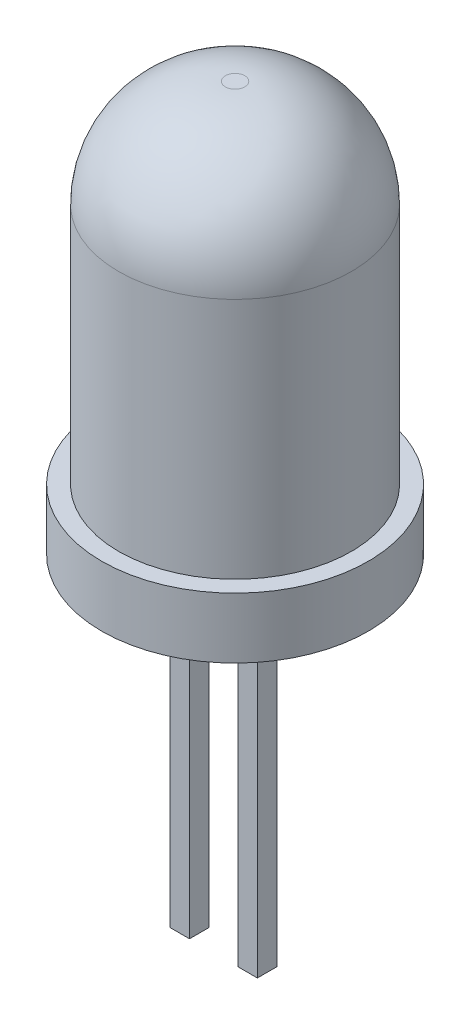
ISO-10303-21;
HEADER;
FILE_DESCRIPTION(('STEP AP214'),'2;1');
FILE_NAME('part.step','',(''),(''),'','','');
FILE_SCHEMA(('AUTOMOTIVE_DESIGN { 1 0 10303 214 1 1 1 1 }'));
ENDSEC;
DATA;
#1=APPLICATION_CONTEXT('core data for automotive mechanical design processes');
#2=APPLICATION_PROTOCOL_DEFINITION('international standard','automotive_design',2000,#1);
#3=PRODUCT_CONTEXT('',#1,'mechanical');
#4=PRODUCT('Part','Part','',(#3));
#5=PRODUCT_RELATED_PRODUCT_CATEGORY('part','',(#4));
#6=PRODUCT_DEFINITION_FORMATION('','',#4);
#7=PRODUCT_DEFINITION_CONTEXT('part definition',#1,'design');
#8=PRODUCT_DEFINITION('design','',#6,#7);
#9=PRODUCT_DEFINITION_SHAPE('','',#8);
#10=(LENGTH_UNIT() NAMED_UNIT(*) SI_UNIT(.MILLI.,.METRE.));
#11=(NAMED_UNIT(*) PLANE_ANGLE_UNIT() SI_UNIT($,.RADIAN.));
#12=(NAMED_UNIT(*) SI_UNIT($,.STERADIAN.) SOLID_ANGLE_UNIT());
#13=UNCERTAINTY_MEASURE_WITH_UNIT(LENGTH_MEASURE(1.E-05),#10,'distance_accuracy_value','');
#14=(GEOMETRIC_REPRESENTATION_CONTEXT(3) GLOBAL_UNCERTAINTY_ASSIGNED_CONTEXT((#13)) GLOBAL_UNIT_ASSIGNED_CONTEXT((#10,
#11,#12)) REPRESENTATION_CONTEXT('',''));
#15=CARTESIAN_POINT('',(0.,0.,0.));
#16=DIRECTION('',(0.,0.,1.));
#17=DIRECTION('',(1.,0.,0.));
#18=AXIS2_PLACEMENT_3D('',#15,#16,#17);
#19=CARTESIAN_POINT('',(0.,0.,0.));
#20=DIRECTION('',(0.,1.,0.));
#21=DIRECTION('',(0.,0.,1.));
#22=AXIS2_PLACEMENT_3D('',#19,#20,#21);
#23=PLANE('',#22);
#24=DIRECTION('',(-1.,0.,0.));
#25=VECTOR('',#24,1.);
#26=CARTESIAN_POINT('',(0.6,0.,-0.260309902991196));
#27=LINE('',#26,#25);
#28=CARTESIAN_POINT('',(0.6,0.,-0.260309902991196));
#29=VERTEX_POINT('',#28);
#30=CARTESIAN_POINT('',(0.2,0.,-0.260309902991196));
#31=VERTEX_POINT('',#30);
#32=EDGE_CURVE('E143',#29,#31,#27,.T.);
#33=ORIENTED_EDGE('',*,*,#32,.T.);
#34=DIRECTION('',(0.,0.,1.));
#35=VECTOR('',#34,1.);
#36=CARTESIAN_POINT('',(0.2,0.,0.139690097008804));
#37=LINE('',#36,#35);
#38=CARTESIAN_POINT('',(0.2,0.,0.139690097008804));
#39=VERTEX_POINT('',#38);
#40=EDGE_CURVE('E111',#31,#39,#37,.T.);
#41=ORIENTED_EDGE('',*,*,#40,.T.);
#42=DIRECTION('',(1.,0.,0.));
#43=VECTOR('',#42,1.);
#44=CARTESIAN_POINT('',(0.6,0.,0.139690097008804));
#45=LINE('',#44,#43);
#46=CARTESIAN_POINT('',(0.6,0.,0.139690097008804));
#47=VERTEX_POINT('',#46);
#48=EDGE_CURVE('E129',#39,#47,#45,.T.);
#49=ORIENTED_EDGE('',*,*,#48,.T.);
#50=DIRECTION('',(0.,0.,-1.));
#51=VECTOR('',#50,1.);
#52=CARTESIAN_POINT('',(0.6,0.,0.139690097008804));
#53=LINE('',#52,#51);
#54=EDGE_CURVE('E55',#47,#29,#53,.T.);
#55=ORIENTED_EDGE('',*,*,#54,.T.);
#56=EDGE_LOOP('',(#33,#41,#49,#55));
#57=FACE_BOUND('',#56,.T.);
#58=CARTESIAN_POINT('',(0.,0.,0.));
#59=DIRECTION('',(0.,1.,0.));
#60=DIRECTION('',(0.,0.,1.));
#61=AXIS2_PLACEMENT_3D('',#58,#59,#60);
#62=CIRCLE('',#61,2.75);
#63=CARTESIAN_POINT('',(0.,0.,2.75));
#64=VERTEX_POINT('',#63);
#65=EDGE_CURVE('E199',#64,#64,#62,.T.);
#66=ORIENTED_EDGE('',*,*,#65,.F.);
#67=EDGE_LOOP('',(#66));
#68=FACE_BOUND('',#67,.T.);
#69=DIRECTION('',(0.,0.,1.));
#70=VECTOR('',#69,1.);
#71=CARTESIAN_POINT('',(-0.8,0.,0.139690097008804));
#72=LINE('',#71,#70);
#73=CARTESIAN_POINT('',(-0.8,0.,-0.260309902991196));
#74=VERTEX_POINT('',#73);
#75=CARTESIAN_POINT('',(-0.8,0.,0.139690097008804));
#76=VERTEX_POINT('',#75);
#77=EDGE_CURVE('E117',#74,#76,#72,.T.);
#78=ORIENTED_EDGE('',*,*,#77,.F.);
#79=DIRECTION('',(1.,0.,0.));
#80=VECTOR('',#79,1.);
#81=CARTESIAN_POINT('',(-1.2,0.,-0.260309902991196));
#82=LINE('',#81,#80);
#83=CARTESIAN_POINT('',(-1.2,0.,-0.260309902991196));
#84=VERTEX_POINT('',#83);
#85=EDGE_CURVE('E163',#84,#74,#82,.T.);
#86=ORIENTED_EDGE('',*,*,#85,.F.);
#87=DIRECTION('',(0.,0.,-1.));
#88=VECTOR('',#87,1.);
#89=CARTESIAN_POINT('',(-1.2,0.,0.139690097008804));
#90=LINE('',#89,#88);
#91=CARTESIAN_POINT('',(-1.2,0.,0.139690097008804));
#92=VERTEX_POINT('',#91);
#93=EDGE_CURVE('E178',#92,#84,#90,.T.);
#94=ORIENTED_EDGE('',*,*,#93,.F.);
#95=DIRECTION('',(-1.,0.,0.));
#96=VECTOR('',#95,1.);
#97=CARTESIAN_POINT('',(-1.2,0.,0.139690097008804));
#98=LINE('',#97,#96);
#99=EDGE_CURVE('E63',#76,#92,#98,.T.);
#100=ORIENTED_EDGE('',*,*,#99,.F.);
#101=EDGE_LOOP('',(#78,#86,#94,#100));
#102=FACE_BOUND('',#101,.T.);
#103=ADVANCED_FACE('F39',(#57,#68,#102),#23,.F.);
#104=CARTESIAN_POINT('',(0.,1.25,0.));
#105=DIRECTION('',(0.,-1.,0.));
#106=DIRECTION('',(0.,0.,-1.));
#107=AXIS2_PLACEMENT_3D('',#104,#105,#106);
#108=CYLINDRICAL_SURFACE('',#107,2.75);
#109=CARTESIAN_POINT('',(0.,1.25,0.));
#110=DIRECTION('',(0.,1.,0.));
#111=DIRECTION('',(0.,0.,1.));
#112=AXIS2_PLACEMENT_3D('',#109,#110,#111);
#113=CIRCLE('',#112,2.75);
#114=CARTESIAN_POINT('',(0.,1.25,2.75));
#115=VERTEX_POINT('',#114);
#116=EDGE_CURVE('E204',#115,#115,#113,.T.);
#117=ORIENTED_EDGE('',*,*,#116,.F.);
#118=EDGE_LOOP('',(#117));
#119=FACE_BOUND('',#118,.T.);
#120=ORIENTED_EDGE('',*,*,#65,.T.);
#121=EDGE_LOOP('',(#120));
#122=FACE_BOUND('',#121,.T.);
#123=ADVANCED_FACE('F230',(#119,#122),#108,.T.);
#124=CARTESIAN_POINT('',(0.,1.25,0.));
#125=DIRECTION('',(0.,1.,0.));
#126=DIRECTION('',(0.,0.,1.));
#127=AXIS2_PLACEMENT_3D('',#124,#125,#126);
#128=PLANE('',#127);
#129=CARTESIAN_POINT('',(0.,1.25,0.));
#130=DIRECTION('',(0.,1.,0.));
#131=DIRECTION('',(0.,0.,1.));
#132=AXIS2_PLACEMENT_3D('',#129,#130,#131);
#133=CIRCLE('',#132,2.4);
#134=CARTESIAN_POINT('',(0.,1.25,2.4));
#135=VERTEX_POINT('',#134);
#136=EDGE_CURVE('E200',#135,#135,#133,.T.);
#137=ORIENTED_EDGE('',*,*,#136,.F.);
#138=EDGE_LOOP('',(#137));
#139=FACE_BOUND('',#138,.T.);
#140=ORIENTED_EDGE('',*,*,#116,.T.);
#141=EDGE_LOOP('',(#140));
#142=FACE_BOUND('',#141,.T.);
#143=ADVANCED_FACE('F236',(#139,#142),#128,.T.);
#144=CARTESIAN_POINT('',(0.,8.45,0.));
#145=DIRECTION('',(0.,-1.,0.));
#146=DIRECTION('',(0.,0.,-1.));
#147=AXIS2_PLACEMENT_3D('',#144,#145,#146);
#148=CYLINDRICAL_SURFACE('',#147,2.4);
#149=CARTESIAN_POINT('',(0.,6.25,0.));
#150=DIRECTION('',(0.,1.,0.));
#151=DIRECTION('',(0.,0.,1.));
#152=AXIS2_PLACEMENT_3D('',#149,#150,#151);
#153=CIRCLE('',#152,2.4);
#154=CARTESIAN_POINT('',(0.,6.25,2.4));
#155=VERTEX_POINT('',#154);
#156=EDGE_CURVE('E11',#155,#155,#153,.F.);
#157=ORIENTED_EDGE('',*,*,#156,.T.);
#158=EDGE_LOOP('',(#157));
#159=FACE_BOUND('',#158,.T.);
#160=ORIENTED_EDGE('',*,*,#136,.T.);
#161=EDGE_LOOP('',(#160));
#162=FACE_BOUND('',#161,.T.);
#163=ADVANCED_FACE('F226',(#159,#162),#148,.T.);
#164=CARTESIAN_POINT('',(0.,8.45,0.));
#165=DIRECTION('',(0.,1.,0.));
#166=DIRECTION('',(0.,0.,1.));
#167=AXIS2_PLACEMENT_3D('',#164,#165,#166);
#168=PLANE('',#167);
#169=CARTESIAN_POINT('',(0.,8.45,0.));
#170=DIRECTION('',(0.,1.,0.));
#171=DIRECTION('',(0.,0.,1.));
#172=AXIS2_PLACEMENT_3D('',#169,#170,#171);
#173=CIRCLE('',#172,0.2);
#174=CARTESIAN_POINT('',(0.,8.45,0.2));
#175=VERTEX_POINT('',#174);
#176=EDGE_CURVE('E48',#175,#175,#173,.T.);
#177=ORIENTED_EDGE('',*,*,#176,.T.);
#178=EDGE_LOOP('',(#177));
#179=FACE_BOUND('',#178,.T.);
#180=ADVANCED_FACE('F214',(#179),#168,.T.);
#181=CARTESIAN_POINT('',(0.,6.25,0.));
#182=DIRECTION('',(0.,1.,0.));
#183=DIRECTION('',(0.,0.,1.));
#184=AXIS2_PLACEMENT_3D('',#181,#182,#183);
#185=DEGENERATE_TOROIDAL_SURFACE('',#184,0.2,2.2,.T.);
#186=ORIENTED_EDGE('',*,*,#156,.F.);
#187=EDGE_LOOP('',(#186));
#188=FACE_BOUND('',#187,.T.);
#189=ORIENTED_EDGE('',*,*,#176,.F.);
#190=EDGE_LOOP('',(#189));
#191=FACE_BOUND('',#190,.T.);
#192=ADVANCED_FACE('F41',(#188,#191),#185,.T.);
#193=CARTESIAN_POINT('',(-0.8,-7.2,0.139690097008804));
#194=DIRECTION('',(-1.,0.,0.));
#195=DIRECTION('',(0.,0.,1.));
#196=AXIS2_PLACEMENT_3D('',#193,#194,#195);
#197=PLANE('',#196);
#198=ORIENTED_EDGE('',*,*,#77,.T.);
#199=DIRECTION('',(0.,1.,0.));
#200=VECTOR('',#199,1.);
#201=CARTESIAN_POINT('',(-0.8,-7.2,0.139690097008804));
#202=LINE('',#201,#200);
#203=CARTESIAN_POINT('',(-0.8,-7.2,0.139690097008804));
#204=VERTEX_POINT('',#203);
#205=EDGE_CURVE('E196',#204,#76,#202,.T.);
#206=ORIENTED_EDGE('',*,*,#205,.F.);
#207=DIRECTION('',(0.,0.,1.));
#208=VECTOR('',#207,1.);
#209=CARTESIAN_POINT('',(-0.8,-7.2,0.139690097008804));
#210=LINE('',#209,#208);
#211=CARTESIAN_POINT('',(-0.8,-7.2,-0.260309902991196));
#212=VERTEX_POINT('',#211);
#213=EDGE_CURVE('E158',#212,#204,#210,.T.);
#214=ORIENTED_EDGE('',*,*,#213,.F.);
#215=DIRECTION('',(0.,1.,0.));
#216=VECTOR('',#215,1.);
#217=CARTESIAN_POINT('',(-0.8,-7.2,-0.260309902991196));
#218=LINE('',#217,#216);
#219=EDGE_CURVE('E172',#212,#74,#218,.T.);
#220=ORIENTED_EDGE('',*,*,#219,.T.);
#221=EDGE_LOOP('',(#198,#206,#214,#220));
#222=FACE_BOUND('',#221,.T.);
#223=ADVANCED_FACE('F217',(#222),#197,.F.);
#224=CARTESIAN_POINT('',(-1.2,-7.2,0.139690097008804));
#225=DIRECTION('',(0.,0.,-1.));
#226=DIRECTION('',(-1.,0.,0.));
#227=AXIS2_PLACEMENT_3D('',#224,#225,#226);
#228=PLANE('',#227);
#229=ORIENTED_EDGE('',*,*,#99,.T.);
#230=DIRECTION('',(0.,1.,0.));
#231=VECTOR('',#230,1.);
#232=CARTESIAN_POINT('',(-1.2,-7.2,0.139690097008804));
#233=LINE('',#232,#231);
#234=CARTESIAN_POINT('',(-1.2,-7.2,0.139690097008804));
#235=VERTEX_POINT('',#234);
#236=EDGE_CURVE('E192',#235,#92,#233,.T.);
#237=ORIENTED_EDGE('',*,*,#236,.F.);
#238=DIRECTION('',(-1.,0.,0.));
#239=VECTOR('',#238,1.);
#240=CARTESIAN_POINT('',(-1.2,-7.2,0.139690097008804));
#241=LINE('',#240,#239);
#242=EDGE_CURVE('E162',#204,#235,#241,.T.);
#243=ORIENTED_EDGE('',*,*,#242,.F.);
#244=ORIENTED_EDGE('',*,*,#205,.T.);
#245=EDGE_LOOP('',(#229,#237,#243,#244));
#246=FACE_BOUND('',#245,.T.);
#247=ADVANCED_FACE('F223',(#246),#228,.F.);
#248=CARTESIAN_POINT('',(-1.2,-7.2,0.139690097008804));
#249=DIRECTION('',(1.,0.,0.));
#250=DIRECTION('',(0.,0.,-1.));
#251=AXIS2_PLACEMENT_3D('',#248,#249,#250);
#252=PLANE('',#251);
#253=ORIENTED_EDGE('',*,*,#93,.T.);
#254=DIRECTION('',(0.,1.,0.));
#255=VECTOR('',#254,1.);
#256=CARTESIAN_POINT('',(-1.2,-7.2,-0.260309902991196));
#257=LINE('',#256,#255);
#258=CARTESIAN_POINT('',(-1.2,-7.2,-0.260309902991196));
#259=VERTEX_POINT('',#258);
#260=EDGE_CURVE('E188',#259,#84,#257,.T.);
#261=ORIENTED_EDGE('',*,*,#260,.F.);
#262=DIRECTION('',(0.,0.,-1.));
#263=VECTOR('',#262,1.);
#264=CARTESIAN_POINT('',(-1.2,-7.2,0.139690097008804));
#265=LINE('',#264,#263);
#266=EDGE_CURVE('E166',#235,#259,#265,.T.);
#267=ORIENTED_EDGE('',*,*,#266,.F.);
#268=ORIENTED_EDGE('',*,*,#236,.T.);
#269=EDGE_LOOP('',(#253,#261,#267,#268));
#270=FACE_BOUND('',#269,.T.);
#271=ADVANCED_FACE('F248',(#270),#252,.F.);
#272=CARTESIAN_POINT('',(-1.2,-7.2,-0.260309902991196));
#273=DIRECTION('',(0.,0.,1.));
#274=DIRECTION('',(1.,0.,0.));
#275=AXIS2_PLACEMENT_3D('',#272,#273,#274);
#276=PLANE('',#275);
#277=ORIENTED_EDGE('',*,*,#85,.T.);
#278=ORIENTED_EDGE('',*,*,#219,.F.);
#279=DIRECTION('',(1.,0.,0.));
#280=VECTOR('',#279,1.);
#281=CARTESIAN_POINT('',(-1.2,-7.2,-0.260309902991196));
#282=LINE('',#281,#280);
#283=EDGE_CURVE('E169',#259,#212,#282,.T.);
#284=ORIENTED_EDGE('',*,*,#283,.F.);
#285=ORIENTED_EDGE('',*,*,#260,.T.);
#286=EDGE_LOOP('',(#277,#278,#284,#285));
#287=FACE_BOUND('',#286,.T.);
#288=ADVANCED_FACE('F252',(#287),#276,.F.);
#289=CARTESIAN_POINT('',(0.,-7.2,0.));
#290=DIRECTION('',(0.,-1.,0.));
#291=DIRECTION('',(0.,0.,-1.));
#292=AXIS2_PLACEMENT_3D('',#289,#290,#291);
#293=PLANE('',#292);
#294=ORIENTED_EDGE('',*,*,#213,.T.);
#295=ORIENTED_EDGE('',*,*,#242,.T.);
#296=ORIENTED_EDGE('',*,*,#266,.T.);
#297=ORIENTED_EDGE('',*,*,#283,.T.);
#298=EDGE_LOOP('',(#294,#295,#296,#297));
#299=FACE_BOUND('',#298,.T.);
#300=ADVANCED_FACE('F256',(#299),#293,.T.);
#301=CARTESIAN_POINT('',(0.2,-7.2,0.139690097008804));
#302=DIRECTION('',(-1.,0.,0.));
#303=DIRECTION('',(0.,0.,1.));
#304=AXIS2_PLACEMENT_3D('',#301,#302,#303);
#305=PLANE('',#304);
#306=ORIENTED_EDGE('',*,*,#40,.F.);
#307=DIRECTION('',(0.,1.,0.));
#308=VECTOR('',#307,1.);
#309=CARTESIAN_POINT('',(0.2,-7.2,-0.260309902991196));
#310=LINE('',#309,#308);
#311=CARTESIAN_POINT('',(0.2,-7.2,-0.260309902991196));
#312=VERTEX_POINT('',#311);
#313=EDGE_CURVE('E105',#312,#31,#310,.T.);
#314=ORIENTED_EDGE('',*,*,#313,.F.);
#315=DIRECTION('',(0.,0.,1.));
#316=VECTOR('',#315,1.);
#317=CARTESIAN_POINT('',(0.2,-7.2,0.139690097008804));
#318=LINE('',#317,#316);
#319=CARTESIAN_POINT('',(0.2,-7.2,0.139690097008804));
#320=VERTEX_POINT('',#319);
#321=EDGE_CURVE('E108',#312,#320,#318,.T.);
#322=ORIENTED_EDGE('',*,*,#321,.T.);
#323=DIRECTION('',(0.,1.,0.));
#324=VECTOR('',#323,1.);
#325=CARTESIAN_POINT('',(0.2,-7.2,0.139690097008804));
#326=LINE('',#325,#324);
#327=EDGE_CURVE('E140',#320,#39,#326,.T.);
#328=ORIENTED_EDGE('',*,*,#327,.T.);
#329=EDGE_LOOP('',(#306,#314,#322,#328));
#330=FACE_BOUND('',#329,.T.);
#331=ADVANCED_FACE('F107',(#330),#305,.T.);
#332=CARTESIAN_POINT('',(0.6,-7.2,-0.260309902991196));
#333=DIRECTION('',(0.,0.,-1.));
#334=DIRECTION('',(-1.,0.,0.));
#335=AXIS2_PLACEMENT_3D('',#332,#333,#334);
#336=PLANE('',#335);
#337=ORIENTED_EDGE('',*,*,#32,.F.);
#338=DIRECTION('',(0.,1.,0.));
#339=VECTOR('',#338,1.);
#340=CARTESIAN_POINT('',(0.6,-7.2,-0.260309902991196));
#341=LINE('',#340,#339);
#342=CARTESIAN_POINT('',(0.6,-7.2,-0.260309902991196));
#343=VERTEX_POINT('',#342);
#344=EDGE_CURVE('E118',#343,#29,#341,.T.);
#345=ORIENTED_EDGE('',*,*,#344,.F.);
#346=DIRECTION('',(-1.,0.,0.));
#347=VECTOR('',#346,1.);
#348=CARTESIAN_POINT('',(0.6,-7.2,-0.260309902991196));
#349=LINE('',#348,#347);
#350=EDGE_CURVE('E124',#343,#312,#349,.T.);
#351=ORIENTED_EDGE('',*,*,#350,.T.);
#352=ORIENTED_EDGE('',*,*,#313,.T.);
#353=EDGE_LOOP('',(#337,#345,#351,#352));
#354=FACE_BOUND('',#353,.T.);
#355=ADVANCED_FACE('F131',(#354),#336,.T.);
#356=CARTESIAN_POINT('',(0.6,-7.2,0.139690097008804));
#357=DIRECTION('',(1.,0.,0.));
#358=DIRECTION('',(0.,0.,-1.));
#359=AXIS2_PLACEMENT_3D('',#356,#357,#358);
#360=PLANE('',#359);
#361=ORIENTED_EDGE('',*,*,#54,.F.);
#362=DIRECTION('',(0.,1.,0.));
#363=VECTOR('',#362,1.);
#364=CARTESIAN_POINT('',(0.6,-7.2,0.139690097008804));
#365=LINE('',#364,#363);
#366=CARTESIAN_POINT('',(0.6,-7.2,0.139690097008804));
#367=VERTEX_POINT('',#366);
#368=EDGE_CURVE('E153',#367,#47,#365,.T.);
#369=ORIENTED_EDGE('',*,*,#368,.F.);
#370=DIRECTION('',(0.,0.,-1.));
#371=VECTOR('',#370,1.);
#372=CARTESIAN_POINT('',(0.6,-7.2,0.139690097008804));
#373=LINE('',#372,#371);
#374=EDGE_CURVE('E133',#367,#343,#373,.T.);
#375=ORIENTED_EDGE('',*,*,#374,.T.);
#376=ORIENTED_EDGE('',*,*,#344,.T.);
#377=EDGE_LOOP('',(#361,#369,#375,#376));
#378=FACE_BOUND('',#377,.T.);
#379=ADVANCED_FACE('F265',(#378),#360,.T.);
#380=CARTESIAN_POINT('',(0.6,-7.2,0.139690097008804));
#381=DIRECTION('',(0.,0.,1.));
#382=DIRECTION('',(1.,0.,0.));
#383=AXIS2_PLACEMENT_3D('',#380,#381,#382);
#384=PLANE('',#383);
#385=ORIENTED_EDGE('',*,*,#48,.F.);
#386=ORIENTED_EDGE('',*,*,#327,.F.);
#387=DIRECTION('',(1.,0.,0.));
#388=VECTOR('',#387,1.);
#389=CARTESIAN_POINT('',(0.6,-7.2,0.139690097008804));
#390=LINE('',#389,#388);
#391=EDGE_CURVE('E127',#320,#367,#390,.T.);
#392=ORIENTED_EDGE('',*,*,#391,.T.);
#393=ORIENTED_EDGE('',*,*,#368,.T.);
#394=EDGE_LOOP('',(#385,#386,#392,#393));
#395=FACE_BOUND('',#394,.T.);
#396=ADVANCED_FACE('F268',(#395),#384,.T.);
#397=CARTESIAN_POINT('',(-0.6,-7.2,0.));
#398=DIRECTION('',(0.,-1.,0.));
#399=DIRECTION('',(0.,0.,-1.));
#400=AXIS2_PLACEMENT_3D('',#397,#398,#399);
#401=PLANE('',#400);
#402=ORIENTED_EDGE('',*,*,#321,.F.);
#403=ORIENTED_EDGE('',*,*,#350,.F.);
#404=ORIENTED_EDGE('',*,*,#374,.F.);
#405=ORIENTED_EDGE('',*,*,#391,.F.);
#406=EDGE_LOOP('',(#402,#403,#404,#405));
#407=FACE_BOUND('',#406,.T.);
#408=ADVANCED_FACE('F122',(#407),#401,.T.);
#409=CLOSED_SHELL('',(#103,#123,#143,#163,#180,#192,#223,#247,#271,#288,#300,#331,#355,#379,
#396,#408));
#410=MANIFOLD_SOLID_BREP('B2',#409);
#411=ADVANCED_BREP_SHAPE_REPRESENTATION('',(#18,#410),#14);
#412=SHAPE_DEFINITION_REPRESENTATION(#9,#411);
ENDSEC;
END-ISO-10303-21;
